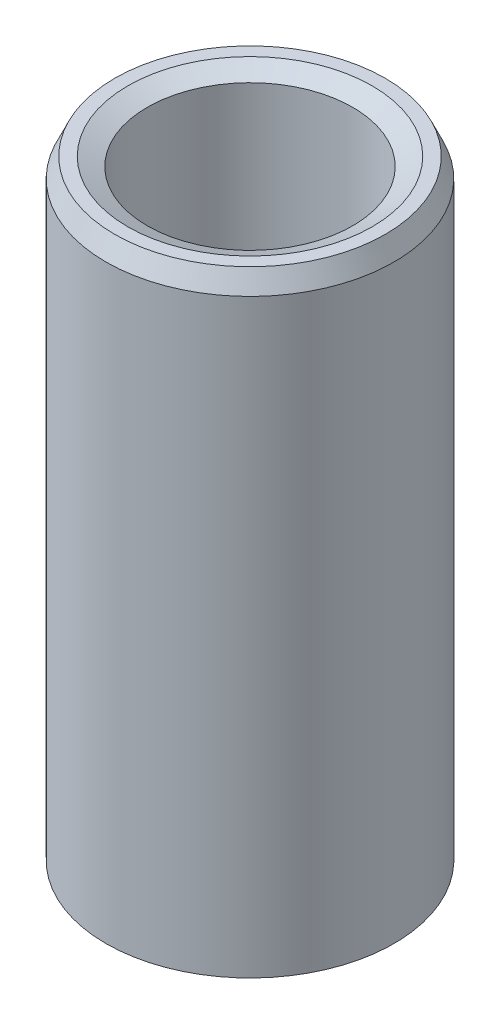
ISO-10303-21;
HEADER;
FILE_DESCRIPTION(('STEP AP214'),'2;1');
FILE_NAME('part.step','',(''),(''),'','','');
FILE_SCHEMA(('AUTOMOTIVE_DESIGN { 1 0 10303 214 1 1 1 1 }'));
ENDSEC;
DATA;
#1=APPLICATION_CONTEXT('core data for automotive mechanical design processes');
#2=APPLICATION_PROTOCOL_DEFINITION('international standard','automotive_design',2000,#1);
#3=PRODUCT_CONTEXT('',#1,'mechanical');
#4=PRODUCT('Part','Part','',(#3));
#5=PRODUCT_RELATED_PRODUCT_CATEGORY('part','',(#4));
#6=PRODUCT_DEFINITION_FORMATION('','',#4);
#7=PRODUCT_DEFINITION_CONTEXT('part definition',#1,'design');
#8=PRODUCT_DEFINITION('design','',#6,#7);
#9=PRODUCT_DEFINITION_SHAPE('','',#8);
#10=(LENGTH_UNIT() NAMED_UNIT(*) SI_UNIT(.MILLI.,.METRE.));
#11=(NAMED_UNIT(*) PLANE_ANGLE_UNIT() SI_UNIT($,.RADIAN.));
#12=(NAMED_UNIT(*) SI_UNIT($,.STERADIAN.) SOLID_ANGLE_UNIT());
#13=UNCERTAINTY_MEASURE_WITH_UNIT(LENGTH_MEASURE(1.E-05),#10,'distance_accuracy_value','');
#14=(GEOMETRIC_REPRESENTATION_CONTEXT(3) GLOBAL_UNCERTAINTY_ASSIGNED_CONTEXT((#13)) GLOBAL_UNIT_ASSIGNED_CONTEXT((#10,
#11,#12)) REPRESENTATION_CONTEXT('',''));
#15=CARTESIAN_POINT('',(0.,0.,0.));
#16=DIRECTION('',(0.,0.,1.));
#17=DIRECTION('',(1.,0.,0.));
#18=AXIS2_PLACEMENT_3D('',#15,#16,#17);
#19=CARTESIAN_POINT('',(0.,64.3867466662551,0.));
#20=DIRECTION('',(0.,-1.,0.));
#21=DIRECTION('',(0.,0.,-1.));
#22=AXIS2_PLACEMENT_3D('',#19,#20,#21);
#23=CYLINDRICAL_SURFACE('',#22,15.);
#24=CARTESIAN_POINT('',(0.,0.922086531893421,0.));
#25=DIRECTION('',(0.,1.,0.));
#26=DIRECTION('',(0.,0.,1.));
#27=AXIS2_PLACEMENT_3D('',#24,#25,#26);
#28=CIRCLE('',#27,15.);
#29=CARTESIAN_POINT('',(0.,0.922086531893421,15.));
#30=VERTEX_POINT('',#29);
#31=EDGE_CURVE('E10',#30,#30,#28,.T.);
#32=ORIENTED_EDGE('',*,*,#31,.T.);
#33=EDGE_LOOP('',(#32));
#34=FACE_BOUND('',#33,.T.);
#35=CARTESIAN_POINT('',(0.,62.3618150830494,0.));
#36=DIRECTION('',(0.,1.,0.));
#37=DIRECTION('',(0.,0.,1.));
#38=AXIS2_PLACEMENT_3D('',#35,#36,#37);
#39=CIRCLE('',#38,15.);
#40=CARTESIAN_POINT('',(0.,62.3618150830494,15.));
#41=VERTEX_POINT('',#40);
#42=EDGE_CURVE('E50',#41,#41,#39,.F.);
#43=ORIENTED_EDGE('',*,*,#42,.T.);
#44=EDGE_LOOP('',(#43));
#45=FACE_BOUND('',#44,.T.);
#46=ADVANCED_FACE('F39',(#34,#45),#23,.T.);
#47=CARTESIAN_POINT('',(0.,64.3867466662551,0.));
#48=DIRECTION('',(0.,1.,0.));
#49=DIRECTION('',(0.,0.,1.));
#50=AXIS2_PLACEMENT_3D('',#47,#48,#49);
#51=PLANE('',#50);
#52=CARTESIAN_POINT('',(0.,64.3867466662551,0.));
#53=DIRECTION('',(0.,1.,0.));
#54=DIRECTION('',(0.,0.,1.));
#55=AXIS2_PLACEMENT_3D('',#52,#53,#54);
#56=CIRCLE('',#55,12.7154533267859);
#57=CARTESIAN_POINT('',(0.,64.3867466662551,12.7154533267858));
#58=VERTEX_POINT('',#57);
#59=EDGE_CURVE('E58',#58,#58,#56,.F.);
#60=ORIENTED_EDGE('',*,*,#59,.T.);
#61=EDGE_LOOP('',(#60));
#62=FACE_BOUND('',#61,.T.);
#63=CARTESIAN_POINT('',(0.,64.3867466662551,0.));
#64=DIRECTION('',(0.,1.,0.));
#65=DIRECTION('',(0.,0.,1.));
#66=AXIS2_PLACEMENT_3D('',#63,#64,#65);
#67=CIRCLE('',#66,14.0779134681066);
#68=CARTESIAN_POINT('',(0.,64.3867466662551,14.0779134681066));
#69=VERTEX_POINT('',#68);
#70=EDGE_CURVE('E61',#69,#69,#67,.T.);
#71=ORIENTED_EDGE('',*,*,#70,.T.);
#72=EDGE_LOOP('',(#71));
#73=FACE_BOUND('',#72,.T.);
#74=ADVANCED_FACE('F88',(#62,#73),#51,.T.);
#75=CARTESIAN_POINT('',(0.,0.,0.));
#76=DIRECTION('',(0.,1.,0.));
#77=DIRECTION('',(0.,0.,1.));
#78=AXIS2_PLACEMENT_3D('',#75,#76,#77);
#79=PLANE('',#78);
#80=CARTESIAN_POINT('',(0.,0.,0.));
#81=DIRECTION('',(0.,1.,0.));
#82=DIRECTION('',(0.,0.,1.));
#83=AXIS2_PLACEMENT_3D('',#80,#81,#82);
#84=CIRCLE('',#83,11.6126082754735);
#85=CARTESIAN_POINT('',(0.,0.,11.6126082754735));
#86=VERTEX_POINT('',#85);
#87=EDGE_CURVE('E51',#86,#86,#84,.T.);
#88=ORIENTED_EDGE('',*,*,#87,.T.);
#89=EDGE_LOOP('',(#88));
#90=FACE_BOUND('',#89,.T.);
#91=CARTESIAN_POINT('',(0.,0.,0.));
#92=DIRECTION('',(0.,1.,0.));
#93=DIRECTION('',(0.,0.,1.));
#94=AXIS2_PLACEMENT_3D('',#91,#92,#93);
#95=CIRCLE('',#94,12.9750684167942);
#96=CARTESIAN_POINT('',(0.,0.,12.9750684167942));
#97=VERTEX_POINT('',#96);
#98=EDGE_CURVE('E54',#97,#97,#95,.F.);
#99=ORIENTED_EDGE('',*,*,#98,.T.);
#100=EDGE_LOOP('',(#99));
#101=FACE_BOUND('',#100,.T.);
#102=ADVANCED_FACE('F83',(#90,#101),#79,.F.);
#103=CARTESIAN_POINT('',(0.,64.3867466662551,0.));
#104=DIRECTION('',(0.,-1.,0.));
#105=DIRECTION('',(0.,0.,-1.));
#106=AXIS2_PLACEMENT_3D('',#103,#104,#105);
#107=CYLINDRICAL_SURFACE('',#106,10.6905217435801);
#108=CARTESIAN_POINT('',(0.,63.4646601343617,0.));
#109=DIRECTION('',(0.,1.,0.));
#110=DIRECTION('',(0.,0.,1.));
#111=AXIS2_PLACEMENT_3D('',#108,#109,#110);
#112=CIRCLE('',#111,10.6905217435801);
#113=CARTESIAN_POINT('',(0.,63.4646601343617,10.6905217435801));
#114=VERTEX_POINT('',#113);
#115=EDGE_CURVE('E67',#114,#114,#112,.T.);
#116=ORIENTED_EDGE('',*,*,#115,.T.);
#117=EDGE_LOOP('',(#116));
#118=FACE_BOUND('',#117,.T.);
#119=CARTESIAN_POINT('',(0.,2.02493158320574,0.));
#120=DIRECTION('',(0.,1.,0.));
#121=DIRECTION('',(0.,0.,1.));
#122=AXIS2_PLACEMENT_3D('',#119,#120,#121);
#123=CIRCLE('',#122,10.6905217435801);
#124=CARTESIAN_POINT('',(0.,2.02493158320574,10.6905217435801));
#125=VERTEX_POINT('',#124);
#126=EDGE_CURVE('E69',#125,#125,#123,.F.);
#127=ORIENTED_EDGE('',*,*,#126,.T.);
#128=EDGE_LOOP('',(#127));
#129=FACE_BOUND('',#128,.T.);
#130=ADVANCED_FACE('F71',(#118,#129),#107,.F.);
#131=CARTESIAN_POINT('',(0.,63.4646601343617,0.));
#132=DIRECTION('',(0.,1.,0.));
#133=DIRECTION('',(0.,0.,1.));
#134=AXIS2_PLACEMENT_3D('',#131,#132,#133);
#135=CONICAL_SURFACE('',#134,10.6905217435801,1.14348837431628);
#136=CARTESIAN_POINT('',(0.,64.3867466662551,12.7154533267858));
#137=CARTESIAN_POINT('',(0.,64.3771415982146,12.6943602894608));
#138=CARTESIAN_POINT('',(0.,64.367536530174,12.6732672521357));
#139=CARTESIAN_POINT('',(0.,64.3483263940929,12.6310811774856));
#140=CARTESIAN_POINT('',(0.,64.3387213260523,12.6099881401605));
#141=CARTESIAN_POINT('',(0.,64.3195111899712,12.5678020655104));
#142=CARTESIAN_POINT('',(0.,64.3099061219307,12.5467090281854));
#143=CARTESIAN_POINT('',(0.,64.2906959858496,12.5045229535352));
#144=CARTESIAN_POINT('',(0.,64.281090917809,12.4834299162102));
#145=CARTESIAN_POINT('',(0.,64.2618807817279,12.4412438415601));
#146=CARTESIAN_POINT('',(0.,64.2522757136873,12.420150804235));
#147=CARTESIAN_POINT('',(0.,64.2330655776062,12.3779647295849));
#148=CARTESIAN_POINT('',(0.,64.2234605095657,12.3568716922598));
#149=CARTESIAN_POINT('',(0.,64.2042503734846,12.3146856176097));
#150=CARTESIAN_POINT('',(0.,64.194645305444,12.2935925802846));
#151=CARTESIAN_POINT('',(0.,64.1754351693629,12.2514065056345));
#152=CARTESIAN_POINT('',(0.,64.1658301013223,12.2303134683095));
#153=CARTESIAN_POINT('',(0.,64.1466199652412,12.1881273936593));
#154=CARTESIAN_POINT('',(0.,64.1370148972007,12.1670343563343));
#155=CARTESIAN_POINT('',(0.,64.1178047611195,12.1248482816842));
#156=CARTESIAN_POINT('',(0.,64.108199693079,12.1037552443591));
#157=CARTESIAN_POINT('',(0.,64.0889895569979,12.061569169709));
#158=CARTESIAN_POINT('',(0.,64.0793844889573,12.0404761323839));
#159=CARTESIAN_POINT('',(0.,64.0601743528762,11.9982900577338));
#160=CARTESIAN_POINT('',(0.,64.0505692848356,11.9771970204087));
#161=CARTESIAN_POINT('',(0.,64.0313591487545,11.9350109457586));
#162=CARTESIAN_POINT('',(0.,64.021754080714,11.9139179084336));
#163=CARTESIAN_POINT('',(0.,64.0025439446329,11.8717318337834));
#164=CARTESIAN_POINT('',(0.,63.9929388765923,11.8506387964584));
#165=CARTESIAN_POINT('',(0.,63.9737287405112,11.8084527218083));
#166=CARTESIAN_POINT('',(0.,63.9641236724706,11.7873596844832));
#167=CARTESIAN_POINT('',(0.,63.9449135363895,11.7451736098331));
#168=CARTESIAN_POINT('',(0.,63.935308468349,11.724080572508));
#169=CARTESIAN_POINT('',(0.,63.9160983322679,11.6818944978579));
#170=CARTESIAN_POINT('',(0.,63.9064932642273,11.6608014605328));
#171=CARTESIAN_POINT('',(0.,63.8872831281462,11.6186153858827));
#172=CARTESIAN_POINT('',(0.,63.8776780601056,11.5975223485577));
#173=CARTESIAN_POINT('',(0.,63.8584679240245,11.5553362739075));
#174=CARTESIAN_POINT('',(0.,63.848862855984,11.5342432365825));
#175=CARTESIAN_POINT('',(0.,63.8296527199028,11.4920571619324));
#176=CARTESIAN_POINT('',(0.,63.8200476518623,11.4709641246073));
#177=CARTESIAN_POINT('',(0.,63.8008375157812,11.4287780499572));
#178=CARTESIAN_POINT('',(0.,63.7912324477406,11.4076850126321));
#179=CARTESIAN_POINT('',(0.,63.7720223116595,11.365498937982));
#180=CARTESIAN_POINT('',(0.,63.7624172436189,11.3444059006569));
#181=CARTESIAN_POINT('',(0.,63.7432071075378,11.3022198260068));
#182=CARTESIAN_POINT('',(0.,63.7336020394973,11.2811267886818));
#183=CARTESIAN_POINT('',(0.,63.7143919034162,11.2389407140316));
#184=CARTESIAN_POINT('',(0.,63.7047868353756,11.2178476767066));
#185=CARTESIAN_POINT('',(0.,63.6855766992945,11.1756616020565));
#186=CARTESIAN_POINT('',(0.,63.6759716312539,11.1545685647314));
#187=CARTESIAN_POINT('',(0.,63.6567614951728,11.1123824900813));
#188=CARTESIAN_POINT('',(0.,63.6471564271323,11.0912894527562));
#189=CARTESIAN_POINT('',(0.,63.6279462910512,11.0491033781061));
#190=CARTESIAN_POINT('',(0.,63.6183412230106,11.028010340781));
#191=CARTESIAN_POINT('',(0.,63.5991310869295,10.9858242661309));
#192=CARTESIAN_POINT('',(0.,63.5895260188889,10.9647312288059));
#193=CARTESIAN_POINT('',(0.,63.5703158828078,10.9225451541557));
#194=CARTESIAN_POINT('',(0.,63.5607108147673,10.9014521168307));
#195=CARTESIAN_POINT('',(0.,63.5415006786861,10.8592660421806));
#196=CARTESIAN_POINT('',(0.,63.5318956106456,10.8381730048555));
#197=CARTESIAN_POINT('',(0.,63.5126854745645,10.7959869302054));
#198=CARTESIAN_POINT('',(0.,63.5030804065239,10.7748938928803));
#199=CARTESIAN_POINT('',(0.,63.4838702704428,10.7327078182302));
#200=CARTESIAN_POINT('',(0.,63.4742652024023,10.7116147809051));
#201=CARTESIAN_POINT('',(0.,63.4646601343617,10.6905217435801));
#202=B_SPLINE_CURVE_WITH_KNOTS('',3,(#136,#137,#138,#139,#140,#141,#142,#143,#144,#145,#146,
#147,#148,#149,#150,#151,#152,#153,#154,#155,#156,#157,#158,#159,#160,#161,#162,#163,#164,#165,
#166,#167,#168,#169,#170,#171,#172,#173,#174,#175,#176,#177,#178,#179,#180,#181,#182,#183,#184,
#185,#186,#187,#188,#189,#190,#191,#192,#193,#194,#195,#196,#197,#198,#199,#200,#201),
.UNSPECIFIED.,.F.,.F.,(4,2,2,2,2,2,2,2,2,2,2,2,2,2,2,2,2,2,2,2,2,2,2,2,2,2,2,2,2,2,2,2,4),(0.,
0.0695310146692873,0.139062029338575,0.208593044007862,0.278124058677155,0.347655073346443,
0.41718608801573,0.486717102685017,0.556248117354309,0.625779132023598,0.695310146692883,
0.764841161362178,0.834372176031464,0.903903190700751,0.973434205370039,1.04296522003933,
1.11249623470862,1.18202724937791,1.2515582640472,1.32108927871649,1.39062029338577,
1.46015130805506,1.52968232272436,1.59921333739364,1.66874435206293,1.73827536673222,
1.80780638140151,1.8773373960708,1.94686841074008,2.01639942540938,2.08593044007866,
2.15546145474795,2.22499246941724),.UNSPECIFIED.);
#203=EDGE_CURVE('BSEAM77',#58,#114,#202,.T.);
#204=ORIENTED_EDGE('',*,*,#59,.F.);
#205=ORIENTED_EDGE('',*,*,#115,.F.);
#206=ORIENTED_EDGE('',*,*,#203,.T.);
#207=ORIENTED_EDGE('',*,*,#203,.F.);
#208=EDGE_LOOP('',(#204,#206,#205,#207));
#209=FACE_BOUND('',#208,.T.);
#210=ADVANCED_FACE('F77',(#209),#135,.F.);
#211=CARTESIAN_POINT('',(0.,0.,0.));
#212=DIRECTION('',(0.,-1.,0.));
#213=DIRECTION('',(0.,0.,-1.));
#214=AXIS2_PLACEMENT_3D('',#211,#212,#213);
#215=CONICAL_SURFACE('',#214,11.6126082754735,0.427307952478613);
#216=ORIENTED_EDGE('',*,*,#126,.F.);
#217=EDGE_LOOP('',(#216));
#218=FACE_BOUND('',#217,.T.);
#219=ORIENTED_EDGE('',*,*,#87,.F.);
#220=EDGE_LOOP('',(#219));
#221=FACE_BOUND('',#220,.T.);
#222=ADVANCED_FACE('F73',(#218,#221),#215,.F.);
#223=CARTESIAN_POINT('',(0.,0.922086531893421,0.));
#224=DIRECTION('',(0.,1.,0.));
#225=DIRECTION('',(0.,0.,1.));
#226=AXIS2_PLACEMENT_3D('',#223,#224,#225);
#227=CONICAL_SURFACE('',#226,15.,1.14348837431628);
#228=CARTESIAN_POINT('',(0.,0.,12.9750684167942));
#229=CARTESIAN_POINT('',(0.,0.00960506804055658,12.9961614541193));
#230=CARTESIAN_POINT('',(0.,0.019210136081113,13.0172544914444));
#231=CARTESIAN_POINT('',(0.,0.0384202721622258,13.0594405660945));
#232=CARTESIAN_POINT('',(0.,0.0480253402027822,13.0805336034195));
#233=CARTESIAN_POINT('',(0.,0.0672354762838951,13.1227196780697));
#234=CARTESIAN_POINT('',(0.,0.0768405443244516,13.1438127153947));
#235=CARTESIAN_POINT('',(0.,0.0960506804055646,13.1859987900448));
#236=CARTESIAN_POINT('',(0.,0.105655748446121,13.2070918273699));
#237=CARTESIAN_POINT('',(0.,0.124865884527234,13.24927790202));
#238=CARTESIAN_POINT('',(0.,0.13447095256779,13.2703709393451));
#239=CARTESIAN_POINT('',(0.,0.153681088648903,13.3125570139952));
#240=CARTESIAN_POINT('',(0.,0.16328615668946,13.3336500513203));
#241=CARTESIAN_POINT('',(0.,0.182496292770573,13.3758361259704));
#242=CARTESIAN_POINT('',(0.,0.192101360811129,13.3969291632954));
#243=CARTESIAN_POINT('',(0.,0.211311496892242,13.4391152379456));
#244=CARTESIAN_POINT('',(0.,0.220916564932798,13.4602082752706));
#245=CARTESIAN_POINT('',(0.,0.240126701013911,13.5023943499207));
#246=CARTESIAN_POINT('',(0.,0.249731769054468,13.5234873872458));
#247=CARTESIAN_POINT('',(0.,0.268941905135581,13.5656734618959));
#248=CARTESIAN_POINT('',(0.,0.278546973176137,13.586766499221));
#249=CARTESIAN_POINT('',(0.,0.29775710925725,13.6289525738711));
#250=CARTESIAN_POINT('',(0.,0.307362177297807,13.6500456111962));
#251=CARTESIAN_POINT('',(0.,0.32657231337892,13.6922316858463));
#252=CARTESIAN_POINT('',(0.,0.336177381419476,13.7133247231713));
#253=CARTESIAN_POINT('',(0.,0.355387517500589,13.7555107978215));
#254=CARTESIAN_POINT('',(0.,0.364992585541146,13.7766038351465));
#255=CARTESIAN_POINT('',(0.,0.384202721622259,13.8187899097966));
#256=CARTESIAN_POINT('',(0.,0.393807789662815,13.8398829471217));
#257=CARTESIAN_POINT('',(0.,0.413017925743928,13.8820690217718));
#258=CARTESIAN_POINT('',(0.,0.422622993784485,13.9031620590969));
#259=CARTESIAN_POINT('',(0.,0.441833129865597,13.945348133747));
#260=CARTESIAN_POINT('',(0.,0.451438197906154,13.9664411710721));
#261=CARTESIAN_POINT('',(0.,0.470648333987267,14.0086272457222));
#262=CARTESIAN_POINT('',(0.,0.480253402027823,14.0297202830472));
#263=CARTESIAN_POINT('',(0.,0.499463538108936,14.0719063576974));
#264=CARTESIAN_POINT('',(0.,0.509068606149493,14.0929993950224));
#265=CARTESIAN_POINT('',(0.,0.528278742230606,14.1351854696725));
#266=CARTESIAN_POINT('',(0.,0.537883810271162,14.1562785069976));
#267=CARTESIAN_POINT('',(0.,0.557093946352275,14.1984645816477));
#268=CARTESIAN_POINT('',(0.,0.566699014392831,14.2195576189728));
#269=CARTESIAN_POINT('',(0.,0.585909150473944,14.2617436936229));
#270=CARTESIAN_POINT('',(0.,0.595514218514501,14.282836730948));
#271=CARTESIAN_POINT('',(0.,0.614724354595614,14.3250228055981));
#272=CARTESIAN_POINT('',(0.,0.62432942263617,14.3461158429231));
#273=CARTESIAN_POINT('',(0.,0.643539558717283,14.3883019175733));
#274=CARTESIAN_POINT('',(0.,0.65314462675784,14.4093949548983));
#275=CARTESIAN_POINT('',(0.,0.672354762838953,14.4515810295484));
#276=CARTESIAN_POINT('',(0.,0.681959830879509,14.4726740668735));
#277=CARTESIAN_POINT('',(0.,0.701169966960622,14.5148601415236));
#278=CARTESIAN_POINT('',(0.,0.710775035001178,14.5359531788487));
#279=CARTESIAN_POINT('',(0.,0.729985171082291,14.5781392534988));
#280=CARTESIAN_POINT('',(0.,0.739590239122848,14.5992322908239));
#281=CARTESIAN_POINT('',(0.,0.758800375203961,14.641418365474));
#282=CARTESIAN_POINT('',(0.,0.768405443244517,14.662511402799));
#283=CARTESIAN_POINT('',(0.,0.78761557932563,14.7046974774492));
#284=CARTESIAN_POINT('',(0.,0.797220647366187,14.7257905147742));
#285=CARTESIAN_POINT('',(0.,0.816430783447299,14.7679765894243));
#286=CARTESIAN_POINT('',(0.,0.826035851487856,14.7890696267494));
#287=CARTESIAN_POINT('',(0.,0.845245987568969,14.8312557013995));
#288=CARTESIAN_POINT('',(0.,0.854851055609526,14.8523487387246));
#289=CARTESIAN_POINT('',(0.,0.874061191690638,14.8945348133747));
#290=CARTESIAN_POINT('',(0.,0.883666259731195,14.9156278506998));
#291=CARTESIAN_POINT('',(0.,0.902876395812308,14.9578139253499));
#292=CARTESIAN_POINT('',(0.,0.912481463852864,14.9789069626749));
#293=CARTESIAN_POINT('',(0.,0.922086531893421,15.));
#294=B_SPLINE_CURVE_WITH_KNOTS('',3,(#228,#229,#230,#231,#232,#233,#234,#235,#236,#237,#238,
#239,#240,#241,#242,#243,#244,#245,#246,#247,#248,#249,#250,#251,#252,#253,#254,#255,#256,#257,
#258,#259,#260,#261,#262,#263,#264,#265,#266,#267,#268,#269,#270,#271,#272,#273,#274,#275,#276,
#277,#278,#279,#280,#281,#282,#283,#284,#285,#286,#287,#288,#289,#290,#291,#292,#293),
.UNSPECIFIED.,.F.,.F.,(4,2,2,2,2,2,2,2,2,2,2,2,2,2,2,2,2,2,2,2,2,2,2,2,2,2,2,2,2,2,2,2,4),(0.,
0.0695310146692874,0.139062029338576,0.208593044007865,0.278124058677154,0.347655073346443,
0.417186088015731,0.48671710268502,0.556248117354309,0.625779132023596,0.695310146692885,
0.764841161362174,0.834372176031463,0.903903190700752,0.973434205370039,1.04296522003933,
1.11249623470862,1.18202724937791,1.25155826404719,1.32108927871648,1.39062029338577,
1.46015130805506,1.52968232272435,1.59921333739364,1.66874435206293,1.73827536673222,
1.8078063814015,1.87733739607079,1.94686841074008,2.01639942540937,2.08593044007866,
2.15546145474795,2.22499246941724),.UNSPECIFIED.);
#295=EDGE_CURVE('BSEAM76',#97,#30,#294,.T.);
#296=ORIENTED_EDGE('',*,*,#98,.F.);
#297=ORIENTED_EDGE('',*,*,#31,.F.);
#298=ORIENTED_EDGE('',*,*,#295,.T.);
#299=ORIENTED_EDGE('',*,*,#295,.F.);
#300=EDGE_LOOP('',(#296,#298,#297,#299));
#301=FACE_BOUND('',#300,.T.);
#302=ADVANCED_FACE('F76',(#301),#227,.T.);
#303=CARTESIAN_POINT('',(0.,64.3867466662551,0.));
#304=DIRECTION('',(0.,-1.,0.));
#305=DIRECTION('',(0.,0.,-1.));
#306=AXIS2_PLACEMENT_3D('',#303,#304,#305);
#307=CONICAL_SURFACE('',#306,14.0779134681066,0.427307952478615);
#308=ORIENTED_EDGE('',*,*,#42,.F.);
#309=EDGE_LOOP('',(#308));
#310=FACE_BOUND('',#309,.T.);
#311=ORIENTED_EDGE('',*,*,#70,.F.);
#312=EDGE_LOOP('',(#311));
#313=FACE_BOUND('',#312,.T.);
#314=ADVANCED_FACE('F45',(#310,#313),#307,.T.);
#315=CLOSED_SHELL('',(#46,#74,#102,#130,#210,#222,#302,#314));
#316=MANIFOLD_SOLID_BREP('B2',#315);
#317=ADVANCED_BREP_SHAPE_REPRESENTATION('',(#18,#316),#14);
#318=SHAPE_DEFINITION_REPRESENTATION(#9,#317);
ENDSEC;
END-ISO-10303-21;
